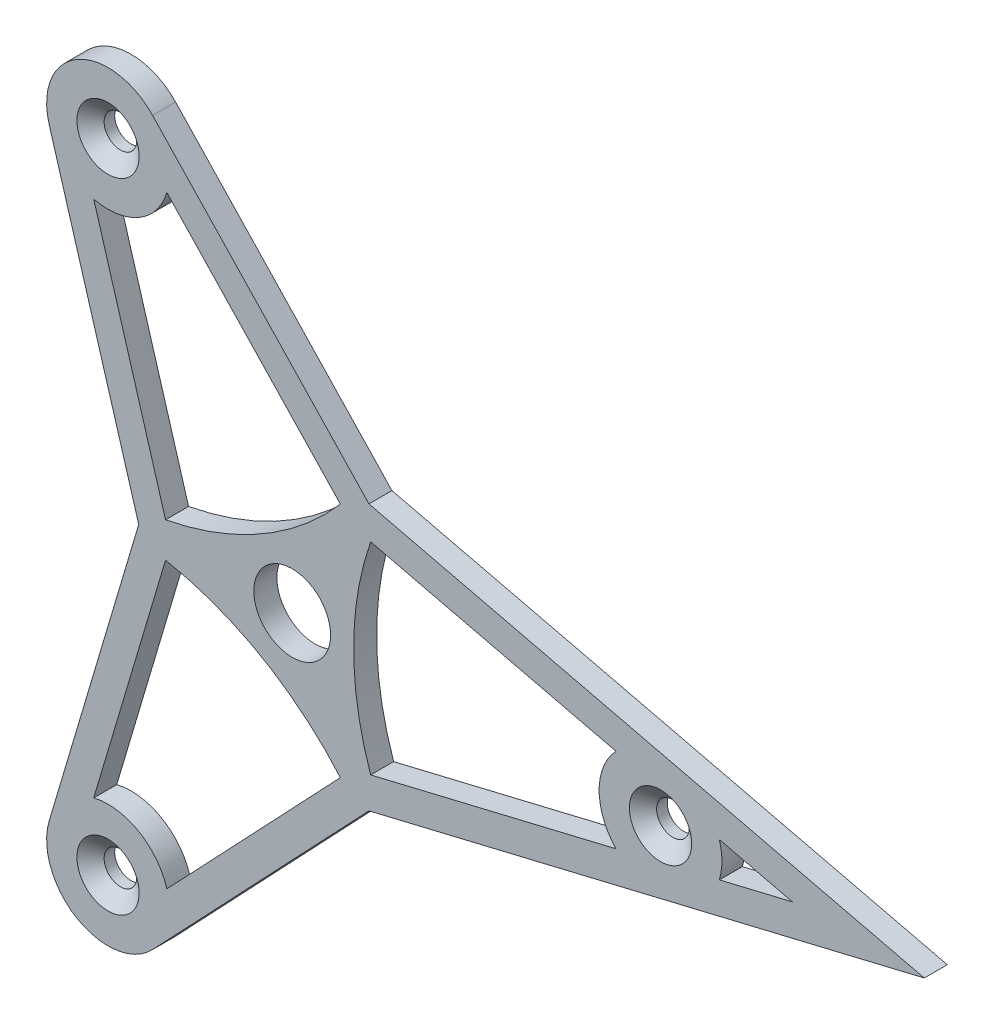
ISO-10303-21;
HEADER;
FILE_DESCRIPTION(('STEP AP214'),'2;1');
FILE_NAME('part.step','',(''),(''),'','','');
FILE_SCHEMA(('AUTOMOTIVE_DESIGN { 1 0 10303 214 1 1 1 1 }'));
ENDSEC;
DATA;
#1=APPLICATION_CONTEXT('core data for automotive mechanical design processes');
#2=APPLICATION_PROTOCOL_DEFINITION('international standard','automotive_design',2000,#1);
#3=PRODUCT_CONTEXT('',#1,'mechanical');
#4=PRODUCT('Part','Part','',(#3));
#5=PRODUCT_RELATED_PRODUCT_CATEGORY('part','',(#4));
#6=PRODUCT_DEFINITION_FORMATION('','',#4);
#7=PRODUCT_DEFINITION_CONTEXT('part definition',#1,'design');
#8=PRODUCT_DEFINITION('design','',#6,#7);
#9=PRODUCT_DEFINITION_SHAPE('','',#8);
#10=(LENGTH_UNIT() NAMED_UNIT(*) SI_UNIT(.MILLI.,.METRE.));
#11=(NAMED_UNIT(*) PLANE_ANGLE_UNIT() SI_UNIT($,.RADIAN.));
#12=(NAMED_UNIT(*) SI_UNIT($,.STERADIAN.) SOLID_ANGLE_UNIT());
#13=UNCERTAINTY_MEASURE_WITH_UNIT(LENGTH_MEASURE(1.E-05),#10,'distance_accuracy_value','');
#14=(GEOMETRIC_REPRESENTATION_CONTEXT(3) GLOBAL_UNCERTAINTY_ASSIGNED_CONTEXT((#13)) GLOBAL_UNIT_ASSIGNED_CONTEXT((#10,
#11,#12)) REPRESENTATION_CONTEXT('',''));
#15=CARTESIAN_POINT('',(0.,0.,0.));
#16=DIRECTION('',(0.,0.,1.));
#17=DIRECTION('',(1.,0.,0.));
#18=AXIS2_PLACEMENT_3D('',#15,#16,#17);
#19=CARTESIAN_POINT('',(-31.75,0.,-4.7625));
#20=DIRECTION('',(-0.958618679777918,0.284693215199875,0.));
#21=DIRECTION('',(-0.284693215199875,-0.958618679777918,0.));
#22=AXIS2_PLACEMENT_3D('',#19,#20,#21);
#23=PLANE('',#22);
#24=DIRECTION('',(-0.284693215199875,-0.958618679777918,0.));
#25=VECTOR('',#24,1.);
#26=CARTESIAN_POINT('',(-31.75,0.,0.));
#27=LINE('',#26,#25);
#28=CARTESIAN_POINT('',(-31.75,0.,0.));
#29=VERTEX_POINT('',#28);
#30=CARTESIAN_POINT('',(-50.2744572331796,-62.3755319353353,0.));
#31=VERTEX_POINT('',#30);
#32=EDGE_CURVE('E372',#29,#31,#27,.T.);
#33=ORIENTED_EDGE('',*,*,#32,.F.);
#34=DIRECTION('',(0.,0.,1.));
#35=VECTOR('',#34,1.);
#36=CARTESIAN_POINT('',(-31.75,0.,-4.7625));
#37=LINE('',#36,#35);
#38=CARTESIAN_POINT('',(-31.75,0.,-4.7625));
#39=VERTEX_POINT('',#38);
#40=EDGE_CURVE('E11',#39,#29,#37,.T.);
#41=ORIENTED_EDGE('',*,*,#40,.F.);
#42=DIRECTION('',(-0.284693215199875,-0.958618679777918,0.));
#43=VECTOR('',#42,1.);
#44=CARTESIAN_POINT('',(-31.75,0.,-4.7625));
#45=LINE('',#44,#43);
#46=CARTESIAN_POINT('',(-50.2744572331796,-62.3755319353353,-4.7625));
#47=VERTEX_POINT('',#46);
#48=EDGE_CURVE('E376',#39,#47,#45,.T.);
#49=ORIENTED_EDGE('',*,*,#48,.T.);
#50=DIRECTION('',(0.,0.,1.));
#51=VECTOR('',#50,1.);
#52=CARTESIAN_POINT('',(-50.2744572331796,-62.3755319353353,-4.7625));
#53=LINE('',#52,#51);
#54=EDGE_CURVE('E42',#47,#31,#53,.T.);
#55=ORIENTED_EDGE('',*,*,#54,.T.);
#56=EDGE_LOOP('',(#33,#41,#49,#55));
#57=FACE_BOUND('',#56,.T.);
#58=ADVANCED_FACE('F39',(#57),#23,.T.);
#59=CARTESIAN_POINT('',(-31.75,0.,-4.7625));
#60=DIRECTION('',(-0.95861867977792,-0.284693215199867,0.));
#61=DIRECTION('',(0.284693215199867,-0.95861867977792,0.));
#62=AXIS2_PLACEMENT_3D('',#59,#60,#61);
#63=PLANE('',#62);
#64=DIRECTION('',(0.284693215199867,-0.95861867977792,0.));
#65=VECTOR('',#64,1.);
#66=CARTESIAN_POINT('',(-31.75,0.,0.));
#67=LINE('',#66,#65);
#68=CARTESIAN_POINT('',(-50.2744572331791,62.3755319353358,0.));
#69=VERTEX_POINT('',#68);
#70=EDGE_CURVE('E381',#69,#29,#67,.T.);
#71=ORIENTED_EDGE('',*,*,#70,.F.);
#72=DIRECTION('',(0.,0.,1.));
#73=VECTOR('',#72,1.);
#74=CARTESIAN_POINT('',(-50.2744572331791,62.3755319353358,-4.7625));
#75=LINE('',#74,#73);
#76=CARTESIAN_POINT('',(-50.2744572331791,62.3755319353358,-4.7625));
#77=VERTEX_POINT('',#76);
#78=EDGE_CURVE('E48',#77,#69,#75,.T.);
#79=ORIENTED_EDGE('',*,*,#78,.F.);
#80=DIRECTION('',(0.284693215199867,-0.95861867977792,0.));
#81=VECTOR('',#80,1.);
#82=CARTESIAN_POINT('',(-31.75,0.,-4.7625));
#83=LINE('',#82,#81);
#84=EDGE_CURVE('E403',#77,#39,#83,.T.);
#85=ORIENTED_EDGE('',*,*,#84,.T.);
#86=ORIENTED_EDGE('',*,*,#40,.T.);
#87=EDGE_LOOP('',(#71,#79,#85,#86));
#88=FACE_BOUND('',#87,.T.);
#89=ADVANCED_FACE('F468',(#88),#63,.T.);
#90=CARTESIAN_POINT('',(-38.0999999999996,65.9911357683741,-4.7625));
#91=DIRECTION('',(0.,0.,1.));
#92=DIRECTION('',(1.,0.,0.));
#93=AXIS2_PLACEMENT_3D('',#90,#91,#92);
#94=CYLINDRICAL_SURFACE('',#93,12.7);
#95=CARTESIAN_POINT('',(-38.0999999999996,65.9911357683741,0.));
#96=DIRECTION('',(0.,0.,1.));
#97=DIRECTION('',(1.,0.,0.));
#98=AXIS2_PLACEMENT_3D('',#95,#96,#97);
#99=CIRCLE('',#98,12.7);
#100=CARTESIAN_POINT('',(-28.8815666139781,74.7267230930756,0.));
#101=VERTEX_POINT('',#100);
#102=EDGE_CURVE('E430',#101,#69,#99,.T.);
#103=ORIENTED_EDGE('',*,*,#102,.F.);
#104=DIRECTION('',(0.,0.,1.));
#105=VECTOR('',#104,1.);
#106=CARTESIAN_POINT('',(-28.8815666139781,74.7267230930756,-4.7625));
#107=LINE('',#106,#105);
#108=CARTESIAN_POINT('',(-28.8815666139781,74.7267230930756,-4.7625));
#109=VERTEX_POINT('',#108);
#110=EDGE_CURVE('E439',#109,#101,#107,.T.);
#111=ORIENTED_EDGE('',*,*,#110,.F.);
#112=CARTESIAN_POINT('',(-38.0999999999996,65.9911357683741,-4.7625));
#113=DIRECTION('',(0.,0.,1.));
#114=DIRECTION('',(1.,0.,0.));
#115=AXIS2_PLACEMENT_3D('',#112,#113,#114);
#116=CIRCLE('',#115,12.7);
#117=EDGE_CURVE('E399',#109,#77,#116,.T.);
#118=ORIENTED_EDGE('',*,*,#117,.T.);
#119=ORIENTED_EDGE('',*,*,#78,.T.);
#120=EDGE_LOOP('',(#103,#111,#118,#119));
#121=FACE_BOUND('',#120,.T.);
#122=ADVANCED_FACE('F488',(#121),#94,.T.);
#123=CARTESIAN_POINT('',(15.8749999999999,27.496306570156,-4.7625));
#124=DIRECTION('',(0.725860896537122,0.687841521630038,0.));
#125=DIRECTION('',(-0.687841521630038,0.725860896537122,0.));
#126=AXIS2_PLACEMENT_3D('',#123,#124,#125);
#127=PLANE('',#126);
#128=DIRECTION('',(-0.687841521630038,0.725860896537122,0.));
#129=VECTOR('',#128,1.);
#130=CARTESIAN_POINT('',(15.8749999999999,27.496306570156,0.));
#131=LINE('',#130,#129);
#132=CARTESIAN_POINT('',(15.8749999999999,27.496306570156,0.));
#133=VERTEX_POINT('',#132);
#134=EDGE_CURVE('E426',#133,#101,#131,.T.);
#135=ORIENTED_EDGE('',*,*,#134,.F.);
#136=DIRECTION('',(0.,0.,1.));
#137=VECTOR('',#136,1.);
#138=CARTESIAN_POINT('',(15.8749999999999,27.496306570156,-4.7625));
#139=LINE('',#138,#137);
#140=CARTESIAN_POINT('',(15.8749999999999,27.496306570156,-4.7625));
#141=VERTEX_POINT('',#140);
#142=EDGE_CURVE('E442',#141,#133,#139,.T.);
#143=ORIENTED_EDGE('',*,*,#142,.F.);
#144=DIRECTION('',(-0.687841521630038,0.725860896537122,0.));
#145=VECTOR('',#144,1.);
#146=CARTESIAN_POINT('',(15.8749999999999,27.496306570156,-4.7625));
#147=LINE('',#146,#145);
#148=EDGE_CURVE('E395',#141,#109,#147,.T.);
#149=ORIENTED_EDGE('',*,*,#148,.T.);
#150=ORIENTED_EDGE('',*,*,#110,.T.);
#151=EDGE_LOOP('',(#135,#143,#149,#150));
#152=FACE_BOUND('',#151,.T.);
#153=ADVANCED_FACE('F486',(#152),#127,.T.);
#154=CARTESIAN_POINT('',(15.8749999999999,27.496306570156,-4.7625));
#155=DIRECTION('',(0.232757783240804,0.972534736829912,0.));
#156=DIRECTION('',(-0.972534736829913,0.232757783240804,0.));
#157=AXIS2_PLACEMENT_3D('',#154,#155,#156);
#158=PLANE('',#157);
#159=DIRECTION('',(-0.972534736829912,0.232757783240804,0.));
#160=VECTOR('',#159,1.);
#161=CARTESIAN_POINT('',(15.8749999999999,27.496306570156,0.));
#162=LINE('',#161,#160);
#163=CARTESIAN_POINT('',(130.763159277303,-3.24393301264684E-13,0.));
#164=VERTEX_POINT('',#163);
#165=EDGE_CURVE('E422',#164,#133,#162,.T.);
#166=ORIENTED_EDGE('',*,*,#165,.F.);
#167=DIRECTION('',(0.,0.,1.));
#168=VECTOR('',#167,1.);
#169=CARTESIAN_POINT('',(130.763159277303,-3.24393301264684E-13,-4.7625));
#170=LINE('',#169,#168);
#171=CARTESIAN_POINT('',(130.763159277303,-3.24393301264684E-13,-4.7625));
#172=VERTEX_POINT('',#171);
#173=EDGE_CURVE('E445',#172,#164,#170,.T.);
#174=ORIENTED_EDGE('',*,*,#173,.F.);
#175=DIRECTION('',(-0.972534736829912,0.232757783240804,0.));
#176=VECTOR('',#175,1.);
#177=CARTESIAN_POINT('',(78.911198700198,12.4097854231473,-4.7625));
#178=LINE('',#177,#176);
#179=EDGE_CURVE('E392',#172,#141,#178,.T.);
#180=ORIENTED_EDGE('',*,*,#179,.T.);
#181=ORIENTED_EDGE('',*,*,#142,.T.);
#182=EDGE_LOOP('',(#166,#174,#180,#181));
#183=FACE_BOUND('',#182,.T.);
#184=ADVANCED_FACE('F481',(#183),#158,.T.);
#185=CARTESIAN_POINT('',(79.1560238471579,-12.3511911577401,-4.7625));
#186=DIRECTION('',(0.2327577832408,-0.972534736829913,0.));
#187=DIRECTION('',(0.972534736829913,0.2327577832408,0.));
#188=AXIS2_PLACEMENT_3D('',#185,#186,#187);
#189=PLANE('',#188);
#190=DIRECTION('',(0.972534736829913,0.2327577832408,0.));
#191=VECTOR('',#190,1.);
#192=CARTESIAN_POINT('',(79.1560238471579,-12.3511911577401,0.));
#193=LINE('',#192,#191);
#194=CARTESIAN_POINT('',(15.8749999999994,-27.4963065701563,0.));
#195=VERTEX_POINT('',#194);
#196=EDGE_CURVE('E418',#195,#164,#193,.T.);
#197=ORIENTED_EDGE('',*,*,#196,.F.);
#198=DIRECTION('',(0.,0.,1.));
#199=VECTOR('',#198,1.);
#200=CARTESIAN_POINT('',(15.8749999999994,-27.4963065701563,-4.7625));
#201=LINE('',#200,#199);
#202=CARTESIAN_POINT('',(15.8749999999994,-27.4963065701563,-4.7625));
#203=VERTEX_POINT('',#202);
#204=EDGE_CURVE('E449',#203,#195,#201,.T.);
#205=ORIENTED_EDGE('',*,*,#204,.F.);
#206=DIRECTION('',(0.972534736829913,0.2327577832408,0.));
#207=VECTOR('',#206,1.);
#208=CARTESIAN_POINT('',(15.8749999999994,-27.4963065701563,-4.7625));
#209=LINE('',#208,#207);
#210=EDGE_CURVE('E389',#203,#172,#209,.T.);
#211=ORIENTED_EDGE('',*,*,#210,.T.);
#212=ORIENTED_EDGE('',*,*,#173,.T.);
#213=EDGE_LOOP('',(#197,#205,#211,#212));
#214=FACE_BOUND('',#213,.T.);
#215=ADVANCED_FACE('F478',(#214),#189,.T.);
#216=CARTESIAN_POINT('',(15.8749999999994,-27.4963065701563,-4.7625));
#217=DIRECTION('',(0.725860896537117,-0.687841521630042,0.));
#218=DIRECTION('',(0.687841521630043,0.725860896537117,0.));
#219=AXIS2_PLACEMENT_3D('',#216,#217,#218);
#220=PLANE('',#219);
#221=DIRECTION('',(0.687841521630043,0.725860896537117,0.));
#222=VECTOR('',#221,1.);
#223=CARTESIAN_POINT('',(15.8749999999994,-27.4963065701563,0.));
#224=LINE('',#223,#222);
#225=CARTESIAN_POINT('',(-28.8815666139786,-74.7267230930753,0.));
#226=VERTEX_POINT('',#225);
#227=EDGE_CURVE('E414',#226,#195,#224,.T.);
#228=ORIENTED_EDGE('',*,*,#227,.F.);
#229=DIRECTION('',(0.,0.,1.));
#230=VECTOR('',#229,1.);
#231=CARTESIAN_POINT('',(-28.8815666139786,-74.7267230930753,-4.7625));
#232=LINE('',#231,#230);
#233=CARTESIAN_POINT('',(-28.8815666139786,-74.7267230930753,-4.7625));
#234=VERTEX_POINT('',#233);
#235=EDGE_CURVE('E452',#234,#226,#232,.T.);
#236=ORIENTED_EDGE('',*,*,#235,.F.);
#237=DIRECTION('',(0.687841521630043,0.725860896537117,0.));
#238=VECTOR('',#237,1.);
#239=CARTESIAN_POINT('',(15.8749999999994,-27.4963065701563,-4.7625));
#240=LINE('',#239,#238);
#241=EDGE_CURVE('E385',#234,#203,#240,.T.);
#242=ORIENTED_EDGE('',*,*,#241,.T.);
#243=ORIENTED_EDGE('',*,*,#204,.T.);
#244=EDGE_LOOP('',(#228,#236,#242,#243));
#245=FACE_BOUND('',#244,.T.);
#246=ADVANCED_FACE('F476',(#245),#220,.T.);
#247=CARTESIAN_POINT('',(-38.1,-65.9911357683737,-4.7625));
#248=DIRECTION('',(0.,0.,1.));
#249=DIRECTION('',(1.,0.,0.));
#250=AXIS2_PLACEMENT_3D('',#247,#248,#249);
#251=CYLINDRICAL_SURFACE('',#250,12.7);
#252=CARTESIAN_POINT('',(-38.1,-65.9911357683737,0.));
#253=DIRECTION('',(0.,0.,1.));
#254=DIRECTION('',(1.,0.,0.));
#255=AXIS2_PLACEMENT_3D('',#252,#253,#254);
#256=CIRCLE('',#255,12.7);
#257=EDGE_CURVE('E410',#31,#226,#256,.T.);
#258=ORIENTED_EDGE('',*,*,#257,.F.);
#259=ORIENTED_EDGE('',*,*,#54,.F.);
#260=CARTESIAN_POINT('',(-38.1,-65.9911357683737,-4.7625));
#261=DIRECTION('',(0.,0.,1.));
#262=DIRECTION('',(1.,0.,0.));
#263=AXIS2_PLACEMENT_3D('',#260,#261,#262);
#264=CIRCLE('',#263,12.7);
#265=EDGE_CURVE('E380',#47,#234,#264,.T.);
#266=ORIENTED_EDGE('',*,*,#265,.T.);
#267=ORIENTED_EDGE('',*,*,#235,.T.);
#268=EDGE_LOOP('',(#258,#259,#266,#267));
#269=FACE_BOUND('',#268,.T.);
#270=ADVANCED_FACE('F462',(#269),#251,.T.);
#271=CARTESIAN_POINT('',(-38.1,-65.9911357683737,-4.7625));
#272=DIRECTION('',(0.,0.,1.));
#273=DIRECTION('',(1.,0.,0.));
#274=AXIS2_PLACEMENT_3D('',#271,#272,#273);
#275=PLANE('',#274);
#276=CARTESIAN_POINT('',(76.2,0.,-4.7625));
#277=DIRECTION('',(0.,0.,1.));
#278=DIRECTION('',(1.,0.,0.));
#279=AXIS2_PLACEMENT_3D('',#276,#277,#278);
#280=CIRCLE('',#279,3.3782);
#281=CARTESIAN_POINT('',(79.5782,0.,-4.7625));
#282=VERTEX_POINT('',#281);
#283=EDGE_CURVE('E794',#282,#282,#280,.T.);
#284=ORIENTED_EDGE('',*,*,#283,.T.);
#285=EDGE_LOOP('',(#284));
#286=FACE_BOUND('',#285,.T.);
#287=CARTESIAN_POINT('',(-38.0999999999992,65.9911357683743,-4.7625));
#288=DIRECTION('',(0.,0.,1.));
#289=DIRECTION('',(1.,0.,0.));
#290=AXIS2_PLACEMENT_3D('',#287,#288,#289);
#291=CIRCLE('',#290,3.3782);
#292=CARTESIAN_POINT('',(-34.7217999999992,65.9911357683743,-4.7625));
#293=VERTEX_POINT('',#292);
#294=EDGE_CURVE('E808',#293,#293,#291,.T.);
#295=ORIENTED_EDGE('',*,*,#294,.T.);
#296=EDGE_LOOP('',(#295));
#297=FACE_BOUND('',#296,.T.);
#298=CARTESIAN_POINT('',(-38.0999999999997,-65.9911357683735,-4.7625));
#299=DIRECTION('',(0.,0.,1.));
#300=DIRECTION('',(1.,0.,0.));
#301=AXIS2_PLACEMENT_3D('',#298,#299,#300);
#302=CIRCLE('',#301,3.3782);
#303=CARTESIAN_POINT('',(-34.7217999999997,-65.9911357683735,-4.7625));
#304=VERTEX_POINT('',#303);
#305=EDGE_CURVE('E223',#304,#304,#302,.T.);
#306=ORIENTED_EDGE('',*,*,#305,.T.);
#307=EDGE_LOOP('',(#306));
#308=FACE_BOUND('',#307,.T.);
#309=DIRECTION('',(0.972534736829913,0.2327577832408,0.));
#310=VECTOR('',#309,1.);
#311=CARTESIAN_POINT('',(16.2316117473112,-20.8816285374198,-4.7625));
#312=LINE('',#311,#310);
#313=CARTESIAN_POINT('',(16.2316117473112,-20.8816285374198,-4.7625));
#314=VERTEX_POINT('',#313);
#315=CARTESIAN_POINT('',(66.9815666139783,-8.73558732470175,-4.7625));
#316=VERTEX_POINT('',#315);
#317=EDGE_CURVE('E204',#314,#316,#312,.T.);
#318=ORIENTED_EDGE('',*,*,#317,.T.);
#319=CARTESIAN_POINT('',(76.1999999999997,-2.17686979553376E-13,-4.7625));
#320=DIRECTION('',(0.,0.,-1.));
#321=DIRECTION('',(1.,0.,0.));
#322=AXIS2_PLACEMENT_3D('',#319,#320,#321);
#323=CIRCLE('',#322,12.7);
#324=CARTESIAN_POINT('',(66.9815666139783,8.73558732470135,-4.7625));
#325=VERTEX_POINT('',#324);
#326=EDGE_CURVE('E197',#316,#325,#323,.T.);
#327=ORIENTED_EDGE('',*,*,#326,.T.);
#328=DIRECTION('',(-0.972534736829913,0.232757783240804,0.));
#329=VECTOR('',#328,1.);
#330=CARTESIAN_POINT('',(16.2316117473113,20.8816285374197,-4.7625));
#331=LINE('',#330,#329);
#332=CARTESIAN_POINT('',(16.2316117473113,20.8816285374196,-4.7625));
#333=VERTEX_POINT('',#332);
#334=EDGE_CURVE('E207',#325,#333,#331,.T.);
#335=ORIENTED_EDGE('',*,*,#334,.T.);
#336=CARTESIAN_POINT('',(76.1999999999997,-2.17686979553376E-13,-4.7625));
#337=DIRECTION('',(0.,0.,1.));
#338=DIRECTION('',(1.,0.,0.));
#339=AXIS2_PLACEMENT_3D('',#336,#337,#338);
#340=CIRCLE('',#339,63.4999999999997);
#341=EDGE_CURVE('E56',#333,#314,#340,.T.);
#342=ORIENTED_EDGE('',*,*,#341,.T.);
#343=EDGE_LOOP('',(#318,#327,#335,#342));
#344=FACE_BOUND('',#343,.T.);
#345=DIRECTION('',(-0.284693215199875,-0.958618679777917,0.));
#346=VECTOR('',#345,1.);
#347=CARTESIAN_POINT('',(-26.1998266594511,-3.61617384882755,-4.7625));
#348=LINE('',#347,#346);
#349=CARTESIAN_POINT('',(-26.1998266594511,-3.61617384882756,-4.7625));
#350=VERTEX_POINT('',#349);
#351=CARTESIAN_POINT('',(-41.0560238471581,-53.6399446106338,-4.7625));
#352=VERTEX_POINT('',#351);
#353=EDGE_CURVE('E260',#350,#352,#348,.T.);
#354=ORIENTED_EDGE('',*,*,#353,.T.);
#355=CARTESIAN_POINT('',(-38.1,-65.9911357683737,-4.7625));
#356=DIRECTION('',(0.,0.,-1.));
#357=DIRECTION('',(1.,0.,0.));
#358=AXIS2_PLACEMENT_3D('',#355,#356,#357);
#359=CIRCLE('',#358,12.7);
#360=CARTESIAN_POINT('',(-25.9255427668204,-62.3755319353354,-4.7625));
#361=VERTEX_POINT('',#360);
#362=EDGE_CURVE('E247',#352,#361,#359,.T.);
#363=ORIENTED_EDGE('',*,*,#362,.T.);
#364=DIRECTION('',(0.687841521630043,0.725860896537117,0.));
#365=VECTOR('',#364,1.);
#366=CARTESIAN_POINT('',(9.96821491213968,-24.4978023862472,-4.7625));
#367=LINE('',#366,#365);
#368=CARTESIAN_POINT('',(9.96821491213969,-24.4978023862472,-4.7625));
#369=VERTEX_POINT('',#368);
#370=EDGE_CURVE('E251',#361,#369,#367,.T.);
#371=ORIENTED_EDGE('',*,*,#370,.T.);
#372=CARTESIAN_POINT('',(-38.1,-65.9911357683737,-4.7625));
#373=DIRECTION('',(0.,0.,1.));
#374=DIRECTION('',(1.,0.,0.));
#375=AXIS2_PLACEMENT_3D('',#372,#373,#374);
#376=CIRCLE('',#375,63.4999999999996);
#377=EDGE_CURVE('E256',#369,#350,#376,.T.);
#378=ORIENTED_EDGE('',*,*,#377,.T.);
#379=EDGE_LOOP('',(#354,#363,#371,#378));
#380=FACE_BOUND('',#379,.T.);
#381=DIRECTION('',(-0.972534736829912,0.232757783240804,0.));
#382=VECTOR('',#381,1.);
#383=CARTESIAN_POINT('',(88.3744572331793,3.61560383303811,-4.7625));
#384=LINE('',#383,#382);
#385=CARTESIAN_POINT('',(103.481579638652,-2.63677968348475E-13,-4.7625));
#386=VERTEX_POINT('',#385);
#387=CARTESIAN_POINT('',(88.3744572331793,3.61560383303811,-4.7625));
#388=VERTEX_POINT('',#387);
#389=EDGE_CURVE('E300',#386,#388,#384,.T.);
#390=ORIENTED_EDGE('',*,*,#389,.T.);
#391=CARTESIAN_POINT('',(76.1999999999997,-2.17686979553376E-13,-4.7625));
#392=DIRECTION('',(0.,0.,-1.));
#393=DIRECTION('',(1.,0.,0.));
#394=AXIS2_PLACEMENT_3D('',#391,#392,#393);
#395=CIRCLE('',#394,12.7);
#396=CARTESIAN_POINT('',(88.3744572331793,-3.61560383303859,-4.7625));
#397=VERTEX_POINT('',#396);
#398=EDGE_CURVE('E291',#388,#397,#395,.T.);
#399=ORIENTED_EDGE('',*,*,#398,.T.);
#400=DIRECTION('',(0.972534736829913,0.2327577832408,0.));
#401=VECTOR('',#400,1.);
#402=CARTESIAN_POINT('',(88.3744572331793,-3.61560383303859,-4.7625));
#403=LINE('',#402,#401);
#404=EDGE_CURVE('E295',#397,#386,#403,.T.);
#405=ORIENTED_EDGE('',*,*,#404,.T.);
#406=EDGE_LOOP('',(#390,#399,#405));
#407=FACE_BOUND('',#406,.T.);
#408=DIRECTION('',(-0.687841521630038,0.725860896537122,0.));
#409=VECTOR('',#408,1.);
#410=CARTESIAN_POINT('',(9.96821491213995,24.4978023862472,-4.7625));
#411=LINE('',#410,#409);
#412=CARTESIAN_POINT('',(9.96821491213995,24.4978023862472,-4.7625));
#413=VERTEX_POINT('',#412);
#414=CARTESIAN_POINT('',(-25.92554276682,62.3755319353357,-4.7625));
#415=VERTEX_POINT('',#414);
#416=EDGE_CURVE('E337',#413,#415,#411,.T.);
#417=ORIENTED_EDGE('',*,*,#416,.T.);
#418=CARTESIAN_POINT('',(-38.0999999999996,65.9911357683741,-4.7625));
#419=DIRECTION('',(0.,0.,-1.));
#420=DIRECTION('',(1.,0.,0.));
#421=AXIS2_PLACEMENT_3D('',#418,#419,#420);
#422=CIRCLE('',#421,12.7);
#423=CARTESIAN_POINT('',(-41.0560238471578,53.6399446106342,-4.7625));
#424=VERTEX_POINT('',#423);
#425=EDGE_CURVE('E324',#415,#424,#422,.T.);
#426=ORIENTED_EDGE('',*,*,#425,.T.);
#427=DIRECTION('',(0.284693215199867,-0.95861867977792,0.));
#428=VECTOR('',#427,1.);
#429=CARTESIAN_POINT('',(-26.1998266594511,3.61617384882772,-4.7625));
#430=LINE('',#429,#428);
#431=CARTESIAN_POINT('',(-26.1998266594511,3.61617384882773,-4.7625));
#432=VERTEX_POINT('',#431);
#433=EDGE_CURVE('E328',#424,#432,#430,.T.);
#434=ORIENTED_EDGE('',*,*,#433,.T.);
#435=CARTESIAN_POINT('',(-38.0999999999996,65.9911357683741,-4.7625));
#436=DIRECTION('',(0.,0.,1.));
#437=DIRECTION('',(1.,0.,0.));
#438=AXIS2_PLACEMENT_3D('',#435,#436,#437);
#439=CIRCLE('',#438,63.4999999999997);
#440=EDGE_CURVE('E333',#432,#413,#439,.T.);
#441=ORIENTED_EDGE('',*,*,#440,.T.);
#442=EDGE_LOOP('',(#417,#426,#434,#441));
#443=FACE_BOUND('',#442,.T.);
#444=CARTESIAN_POINT('',(0.,0.,-4.7625));
#445=DIRECTION('',(0.,0.,1.));
#446=DIRECTION('',(1.,0.,0.));
#447=AXIS2_PLACEMENT_3D('',#444,#445,#446);
#448=CIRCLE('',#447,7.9375);
#449=CARTESIAN_POINT('',(7.9375,0.,-4.7625));
#450=VERTEX_POINT('',#449);
#451=EDGE_CURVE('E368',#450,#450,#448,.T.);
#452=ORIENTED_EDGE('',*,*,#451,.T.);
#453=EDGE_LOOP('',(#452));
#454=FACE_BOUND('',#453,.T.);
#455=ORIENTED_EDGE('',*,*,#48,.F.);
#456=ORIENTED_EDGE('',*,*,#84,.F.);
#457=ORIENTED_EDGE('',*,*,#117,.F.);
#458=ORIENTED_EDGE('',*,*,#148,.F.);
#459=ORIENTED_EDGE('',*,*,#179,.F.);
#460=ORIENTED_EDGE('',*,*,#210,.F.);
#461=ORIENTED_EDGE('',*,*,#241,.F.);
#462=ORIENTED_EDGE('',*,*,#265,.F.);
#463=EDGE_LOOP('',(#455,#456,#457,#458,#459,#460,#461,#462));
#464=FACE_BOUND('',#463,.T.);
#465=ADVANCED_FACE('F212',(#286,#297,#308,#344,#380,#407,#443,#454,#464),#275,.F.);
#466=CARTESIAN_POINT('',(-38.1,-65.9911357683737,0.));
#467=DIRECTION('',(0.,0.,1.));
#468=DIRECTION('',(1.,0.,0.));
#469=AXIS2_PLACEMENT_3D('',#466,#467,#468);
#470=PLANE('',#469);
#471=CARTESIAN_POINT('',(76.2,0.,0.));
#472=DIRECTION('',(0.,0.,1.));
#473=DIRECTION('',(1.,0.,0.));
#474=AXIS2_PLACEMENT_3D('',#471,#472,#473);
#475=CIRCLE('',#474,6.4389);
#476=CARTESIAN_POINT('',(82.6389,0.,0.));
#477=VERTEX_POINT('',#476);
#478=EDGE_CURVE('E790',#477,#477,#475,.T.);
#479=ORIENTED_EDGE('',*,*,#478,.F.);
#480=EDGE_LOOP('',(#479));
#481=FACE_BOUND('',#480,.T.);
#482=CARTESIAN_POINT('',(-38.0999999999992,65.9911357683743,0.));
#483=DIRECTION('',(0.,0.,1.));
#484=DIRECTION('',(1.,0.,0.));
#485=AXIS2_PLACEMENT_3D('',#482,#483,#484);
#486=CIRCLE('',#485,6.4389);
#487=CARTESIAN_POINT('',(-31.6610999999992,65.9911357683743,0.));
#488=VERTEX_POINT('',#487);
#489=EDGE_CURVE('E800',#488,#488,#486,.T.);
#490=ORIENTED_EDGE('',*,*,#489,.F.);
#491=EDGE_LOOP('',(#490));
#492=FACE_BOUND('',#491,.T.);
#493=CARTESIAN_POINT('',(-38.0999999999997,-65.9911357683735,0.));
#494=DIRECTION('',(0.,0.,1.));
#495=DIRECTION('',(1.,0.,0.));
#496=AXIS2_PLACEMENT_3D('',#493,#494,#495);
#497=CIRCLE('',#496,6.4389);
#498=CARTESIAN_POINT('',(-31.6610999999997,-65.9911357683735,0.));
#499=VERTEX_POINT('',#498);
#500=EDGE_CURVE('E812',#499,#499,#497,.T.);
#501=ORIENTED_EDGE('',*,*,#500,.F.);
#502=EDGE_LOOP('',(#501));
#503=FACE_BOUND('',#502,.T.);
#504=CARTESIAN_POINT('',(76.1999999999997,-2.17686979553376E-13,0.));
#505=DIRECTION('',(0.,0.,-1.));
#506=DIRECTION('',(1.,0.,0.));
#507=AXIS2_PLACEMENT_3D('',#504,#505,#506);
#508=CIRCLE('',#507,12.7);
#509=CARTESIAN_POINT('',(66.9815666139783,-8.73558732470175,0.));
#510=VERTEX_POINT('',#509);
#511=CARTESIAN_POINT('',(66.9815666139783,8.73558732470133,0.));
#512=VERTEX_POINT('',#511);
#513=EDGE_CURVE('E64',#510,#512,#508,.T.);
#514=ORIENTED_EDGE('',*,*,#513,.F.);
#515=DIRECTION('',(0.972534736829913,0.2327577832408,0.));
#516=VECTOR('',#515,1.);
#517=CARTESIAN_POINT('',(16.2316117473112,-20.8816285374198,0.));
#518=LINE('',#517,#516);
#519=CARTESIAN_POINT('',(16.2316117473112,-20.8816285374198,0.));
#520=VERTEX_POINT('',#519);
#521=EDGE_CURVE('E216',#520,#510,#518,.T.);
#522=ORIENTED_EDGE('',*,*,#521,.F.);
#523=CARTESIAN_POINT('',(76.1999999999997,-2.17686979553376E-13,0.));
#524=DIRECTION('',(0.,0.,1.));
#525=DIRECTION('',(1.,0.,0.));
#526=AXIS2_PLACEMENT_3D('',#523,#524,#525);
#527=CIRCLE('',#526,63.4999999999997);
#528=CARTESIAN_POINT('',(16.2316117473113,20.8816285374197,0.));
#529=VERTEX_POINT('',#528);
#530=EDGE_CURVE('E220',#529,#520,#527,.T.);
#531=ORIENTED_EDGE('',*,*,#530,.F.);
#532=DIRECTION('',(-0.972534736829913,0.232757783240804,0.));
#533=VECTOR('',#532,1.);
#534=CARTESIAN_POINT('',(16.2316117473113,20.8816285374197,0.));
#535=LINE('',#534,#533);
#536=EDGE_CURVE('E232',#512,#529,#535,.T.);
#537=ORIENTED_EDGE('',*,*,#536,.F.);
#538=EDGE_LOOP('',(#514,#522,#531,#537));
#539=FACE_BOUND('',#538,.T.);
#540=CARTESIAN_POINT('',(-38.1,-65.9911357683737,0.));
#541=DIRECTION('',(0.,0.,-1.));
#542=DIRECTION('',(1.,0.,0.));
#543=AXIS2_PLACEMENT_3D('',#540,#541,#542);
#544=CIRCLE('',#543,12.7);
#545=CARTESIAN_POINT('',(-41.0560238471581,-53.6399446106338,0.));
#546=VERTEX_POINT('',#545);
#547=CARTESIAN_POINT('',(-25.9255427668204,-62.3755319353354,0.));
#548=VERTEX_POINT('',#547);
#549=EDGE_CURVE('E241',#546,#548,#544,.T.);
#550=ORIENTED_EDGE('',*,*,#549,.F.);
#551=DIRECTION('',(-0.284693215199875,-0.958618679777917,0.));
#552=VECTOR('',#551,1.);
#553=CARTESIAN_POINT('',(-26.1998266594511,-3.61617384882755,0.));
#554=LINE('',#553,#552);
#555=CARTESIAN_POINT('',(-26.1998266594511,-3.61617384882756,0.));
#556=VERTEX_POINT('',#555);
#557=EDGE_CURVE('E252',#556,#546,#554,.T.);
#558=ORIENTED_EDGE('',*,*,#557,.F.);
#559=CARTESIAN_POINT('',(-38.1,-65.9911357683737,0.));
#560=DIRECTION('',(0.,0.,1.));
#561=DIRECTION('',(1.,0.,0.));
#562=AXIS2_PLACEMENT_3D('',#559,#560,#561);
#563=CIRCLE('',#562,63.4999999999996);
#564=CARTESIAN_POINT('',(9.96821491213968,-24.4978023862472,0.));
#565=VERTEX_POINT('',#564);
#566=EDGE_CURVE('E271',#565,#556,#563,.T.);
#567=ORIENTED_EDGE('',*,*,#566,.F.);
#568=DIRECTION('',(0.687841521630043,0.725860896537117,0.));
#569=VECTOR('',#568,1.);
#570=CARTESIAN_POINT('',(9.96821491213968,-24.4978023862472,0.));
#571=LINE('',#570,#569);
#572=EDGE_CURVE('E267',#548,#565,#571,.T.);
#573=ORIENTED_EDGE('',*,*,#572,.F.);
#574=EDGE_LOOP('',(#550,#558,#567,#573));
#575=FACE_BOUND('',#574,.T.);
#576=CARTESIAN_POINT('',(76.1999999999997,-2.17686979553376E-13,0.));
#577=DIRECTION('',(0.,0.,-1.));
#578=DIRECTION('',(1.,0.,0.));
#579=AXIS2_PLACEMENT_3D('',#576,#577,#578);
#580=CIRCLE('',#579,12.7);
#581=CARTESIAN_POINT('',(88.3744572331793,3.61560383303811,0.));
#582=VERTEX_POINT('',#581);
#583=CARTESIAN_POINT('',(88.3744572331793,-3.61560383303858,0.));
#584=VERTEX_POINT('',#583);
#585=EDGE_CURVE('E281',#582,#584,#580,.T.);
#586=ORIENTED_EDGE('',*,*,#585,.F.);
#587=DIRECTION('',(-0.972534736829912,0.232757783240804,0.));
#588=VECTOR('',#587,1.);
#589=CARTESIAN_POINT('',(88.3744572331793,3.61560383303811,0.));
#590=LINE('',#589,#588);
#591=CARTESIAN_POINT('',(103.481579638652,-2.72351585728359E-13,0.));
#592=VERTEX_POINT('',#591);
#593=EDGE_CURVE('E296',#592,#582,#590,.T.);
#594=ORIENTED_EDGE('',*,*,#593,.F.);
#595=DIRECTION('',(0.972534736829913,0.2327577832408,0.));
#596=VECTOR('',#595,1.);
#597=CARTESIAN_POINT('',(88.3744572331793,-3.61560383303859,0.));
#598=LINE('',#597,#596);
#599=EDGE_CURVE('E307',#584,#592,#598,.T.);
#600=ORIENTED_EDGE('',*,*,#599,.F.);
#601=EDGE_LOOP('',(#586,#594,#600));
#602=FACE_BOUND('',#601,.T.);
#603=CARTESIAN_POINT('',(-38.0999999999996,65.9911357683741,0.));
#604=DIRECTION('',(0.,0.,-1.));
#605=DIRECTION('',(1.,0.,0.));
#606=AXIS2_PLACEMENT_3D('',#603,#604,#605);
#607=CIRCLE('',#606,12.7);
#608=CARTESIAN_POINT('',(-25.92554276682,62.3755319353357,0.));
#609=VERTEX_POINT('',#608);
#610=CARTESIAN_POINT('',(-41.0560238471578,53.6399446106342,0.));
#611=VERTEX_POINT('',#610);
#612=EDGE_CURVE('E317',#609,#611,#607,.T.);
#613=ORIENTED_EDGE('',*,*,#612,.F.);
#614=DIRECTION('',(-0.687841521630038,0.725860896537122,0.));
#615=VECTOR('',#614,1.);
#616=CARTESIAN_POINT('',(9.96821491213995,24.4978023862472,0.));
#617=LINE('',#616,#615);
#618=CARTESIAN_POINT('',(9.96821491213995,24.4978023862472,0.));
#619=VERTEX_POINT('',#618);
#620=EDGE_CURVE('E329',#619,#609,#617,.T.);
#621=ORIENTED_EDGE('',*,*,#620,.F.);
#622=CARTESIAN_POINT('',(-38.0999999999996,65.9911357683741,0.));
#623=DIRECTION('',(0.,0.,1.));
#624=DIRECTION('',(1.,0.,0.));
#625=AXIS2_PLACEMENT_3D('',#622,#623,#624);
#626=CIRCLE('',#625,63.4999999999997);
#627=CARTESIAN_POINT('',(-26.1998266594511,3.61617384882773,0.));
#628=VERTEX_POINT('',#627);
#629=EDGE_CURVE('E348',#628,#619,#626,.T.);
#630=ORIENTED_EDGE('',*,*,#629,.F.);
#631=DIRECTION('',(0.284693215199867,-0.95861867977792,0.));
#632=VECTOR('',#631,1.);
#633=CARTESIAN_POINT('',(-26.1998266594511,3.61617384882772,0.));
#634=LINE('',#633,#632);
#635=EDGE_CURVE('E344',#611,#628,#634,.T.);
#636=ORIENTED_EDGE('',*,*,#635,.F.);
#637=EDGE_LOOP('',(#613,#621,#630,#636));
#638=FACE_BOUND('',#637,.T.);
#639=CARTESIAN_POINT('',(0.,0.,0.));
#640=DIRECTION('',(0.,0.,1.));
#641=DIRECTION('',(1.,0.,0.));
#642=AXIS2_PLACEMENT_3D('',#639,#640,#641);
#643=CIRCLE('',#642,7.9375);
#644=CARTESIAN_POINT('',(7.9375,0.,0.));
#645=VERTEX_POINT('',#644);
#646=EDGE_CURVE('E358',#645,#645,#643,.T.);
#647=ORIENTED_EDGE('',*,*,#646,.F.);
#648=EDGE_LOOP('',(#647));
#649=FACE_BOUND('',#648,.T.);
#650=ORIENTED_EDGE('',*,*,#32,.T.);
#651=ORIENTED_EDGE('',*,*,#257,.T.);
#652=ORIENTED_EDGE('',*,*,#227,.T.);
#653=ORIENTED_EDGE('',*,*,#196,.T.);
#654=ORIENTED_EDGE('',*,*,#165,.T.);
#655=ORIENTED_EDGE('',*,*,#134,.T.);
#656=ORIENTED_EDGE('',*,*,#102,.T.);
#657=ORIENTED_EDGE('',*,*,#70,.T.);
#658=EDGE_LOOP('',(#650,#651,#652,#653,#654,#655,#656,#657));
#659=FACE_BOUND('',#658,.T.);
#660=ADVANCED_FACE('F464',(#481,#492,#503,#539,#575,#602,#638,#649,#659),#470,.T.);
#661=CARTESIAN_POINT('',(0.,0.,-4.7625));
#662=DIRECTION('',(0.,0.,1.));
#663=DIRECTION('',(1.,0.,0.));
#664=AXIS2_PLACEMENT_3D('',#661,#662,#663);
#665=CYLINDRICAL_SURFACE('',#664,7.9375);
#666=ORIENTED_EDGE('',*,*,#451,.F.);
#667=EDGE_LOOP('',(#666));
#668=FACE_BOUND('',#667,.T.);
#669=ORIENTED_EDGE('',*,*,#646,.T.);
#670=EDGE_LOOP('',(#669));
#671=FACE_BOUND('',#670,.T.);
#672=ADVANCED_FACE('F554',(#668,#671),#665,.F.);
#673=CARTESIAN_POINT('',(-38.0999999999996,65.9911357683741,-4.7625));
#674=DIRECTION('',(0.,0.,1.));
#675=DIRECTION('',(1.,0.,0.));
#676=AXIS2_PLACEMENT_3D('',#673,#674,#675);
#677=CYLINDRICAL_SURFACE('',#676,12.7);
#678=ORIENTED_EDGE('',*,*,#612,.T.);
#679=DIRECTION('',(0.,0.,1.));
#680=VECTOR('',#679,1.);
#681=CARTESIAN_POINT('',(-41.0560238471578,53.6399446106342,-4.7625));
#682=LINE('',#681,#680);
#683=EDGE_CURVE('E341',#424,#611,#682,.T.);
#684=ORIENTED_EDGE('',*,*,#683,.F.);
#685=ORIENTED_EDGE('',*,*,#425,.F.);
#686=DIRECTION('',(0.,0.,1.));
#687=VECTOR('',#686,1.);
#688=CARTESIAN_POINT('',(-25.92554276682,62.3755319353357,-4.7625));
#689=LINE('',#688,#687);
#690=EDGE_CURVE('E355',#415,#609,#689,.T.);
#691=ORIENTED_EDGE('',*,*,#690,.T.);
#692=EDGE_LOOP('',(#678,#684,#685,#691));
#693=FACE_BOUND('',#692,.T.);
#694=ADVANCED_FACE('F559',(#693),#677,.T.);
#695=CARTESIAN_POINT('',(9.96821491213995,24.4978023862472,-4.7625));
#696=DIRECTION('',(0.725860896537122,0.687841521630038,0.));
#697=DIRECTION('',(-0.687841521630038,0.725860896537122,0.));
#698=AXIS2_PLACEMENT_3D('',#695,#696,#697);
#699=PLANE('',#698);
#700=ORIENTED_EDGE('',*,*,#620,.T.);
#701=ORIENTED_EDGE('',*,*,#690,.F.);
#702=ORIENTED_EDGE('',*,*,#416,.F.);
#703=DIRECTION('',(0.,0.,1.));
#704=VECTOR('',#703,1.);
#705=CARTESIAN_POINT('',(9.96821491213995,24.4978023862472,-4.7625));
#706=LINE('',#705,#704);
#707=EDGE_CURVE('E359',#413,#619,#706,.T.);
#708=ORIENTED_EDGE('',*,*,#707,.T.);
#709=EDGE_LOOP('',(#700,#701,#702,#708));
#710=FACE_BOUND('',#709,.T.);
#711=ADVANCED_FACE('F571',(#710),#699,.F.);
#712=CARTESIAN_POINT('',(-38.0999999999996,65.9911357683741,-4.7625));
#713=DIRECTION('',(0.,0.,1.));
#714=DIRECTION('',(1.,0.,0.));
#715=AXIS2_PLACEMENT_3D('',#712,#713,#714);
#716=CYLINDRICAL_SURFACE('',#715,63.4999999999997);
#717=ORIENTED_EDGE('',*,*,#629,.T.);
#718=ORIENTED_EDGE('',*,*,#707,.F.);
#719=ORIENTED_EDGE('',*,*,#440,.F.);
#720=DIRECTION('',(0.,0.,1.));
#721=VECTOR('',#720,1.);
#722=CARTESIAN_POINT('',(-26.1998266594511,3.61617384882773,-4.7625));
#723=LINE('',#722,#721);
#724=EDGE_CURVE('E362',#432,#628,#723,.T.);
#725=ORIENTED_EDGE('',*,*,#724,.T.);
#726=EDGE_LOOP('',(#717,#718,#719,#725));
#727=FACE_BOUND('',#726,.T.);
#728=ADVANCED_FACE('F581',(#727),#716,.F.);
#729=CARTESIAN_POINT('',(-26.1998266594511,3.61617384882772,-4.7625));
#730=DIRECTION('',(-0.95861867977792,-0.284693215199867,0.));
#731=DIRECTION('',(0.284693215199867,-0.95861867977792,0.));
#732=AXIS2_PLACEMENT_3D('',#729,#730,#731);
#733=PLANE('',#732);
#734=ORIENTED_EDGE('',*,*,#635,.T.);
#735=ORIENTED_EDGE('',*,*,#724,.F.);
#736=ORIENTED_EDGE('',*,*,#433,.F.);
#737=ORIENTED_EDGE('',*,*,#683,.T.);
#738=EDGE_LOOP('',(#734,#735,#736,#737));
#739=FACE_BOUND('',#738,.T.);
#740=ADVANCED_FACE('F591',(#739),#733,.F.);
#741=CARTESIAN_POINT('',(76.1999999999997,-2.17686979553376E-13,-4.7625));
#742=DIRECTION('',(0.,0.,1.));
#743=DIRECTION('',(1.,0.,0.));
#744=AXIS2_PLACEMENT_3D('',#741,#742,#743);
#745=CYLINDRICAL_SURFACE('',#744,12.7);
#746=ORIENTED_EDGE('',*,*,#585,.T.);
#747=DIRECTION('',(0.,0.,1.));
#748=VECTOR('',#747,1.);
#749=CARTESIAN_POINT('',(88.3744572331793,-3.61560383303859,-4.7625));
#750=LINE('',#749,#748);
#751=EDGE_CURVE('E304',#397,#584,#750,.T.);
#752=ORIENTED_EDGE('',*,*,#751,.F.);
#753=ORIENTED_EDGE('',*,*,#398,.F.);
#754=DIRECTION('',(0.,0.,1.));
#755=VECTOR('',#754,1.);
#756=CARTESIAN_POINT('',(88.3744572331793,3.61560383303811,-4.7625));
#757=LINE('',#756,#755);
#758=EDGE_CURVE('E314',#388,#582,#757,.T.);
#759=ORIENTED_EDGE('',*,*,#758,.T.);
#760=EDGE_LOOP('',(#746,#752,#753,#759));
#761=FACE_BOUND('',#760,.T.);
#762=ADVANCED_FACE('F601',(#761),#745,.T.);
#763=CARTESIAN_POINT('',(88.3744572331793,3.61560383303811,-4.7625));
#764=DIRECTION('',(0.232757783240804,0.972534736829912,0.));
#765=DIRECTION('',(-0.972534736829913,0.232757783240804,0.));
#766=AXIS2_PLACEMENT_3D('',#763,#764,#765);
#767=PLANE('',#766);
#768=ORIENTED_EDGE('',*,*,#593,.T.);
#769=ORIENTED_EDGE('',*,*,#758,.F.);
#770=ORIENTED_EDGE('',*,*,#389,.F.);
#771=DIRECTION('',(0.,0.,1.));
#772=VECTOR('',#771,1.);
#773=CARTESIAN_POINT('',(103.481579638652,-2.72351585728359E-13,-4.7625));
#774=LINE('',#773,#772);
#775=EDGE_CURVE('E318',#386,#592,#774,.T.);
#776=ORIENTED_EDGE('',*,*,#775,.T.);
#777=EDGE_LOOP('',(#768,#769,#770,#776));
#778=FACE_BOUND('',#777,.T.);
#779=ADVANCED_FACE('F611',(#778),#767,.F.);
#780=CARTESIAN_POINT('',(88.3744572331793,-3.61560383303859,-4.7625));
#781=DIRECTION('',(0.2327577832408,-0.972534736829913,0.));
#782=DIRECTION('',(0.972534736829913,0.2327577832408,0.));
#783=AXIS2_PLACEMENT_3D('',#780,#781,#782);
#784=PLANE('',#783);
#785=ORIENTED_EDGE('',*,*,#599,.T.);
#786=ORIENTED_EDGE('',*,*,#775,.F.);
#787=ORIENTED_EDGE('',*,*,#404,.F.);
#788=ORIENTED_EDGE('',*,*,#751,.T.);
#789=EDGE_LOOP('',(#785,#786,#787,#788));
#790=FACE_BOUND('',#789,.T.);
#791=ADVANCED_FACE('F621',(#790),#784,.F.);
#792=CARTESIAN_POINT('',(-38.1,-65.9911357683737,-4.7625));
#793=DIRECTION('',(0.,0.,1.));
#794=DIRECTION('',(1.,0.,0.));
#795=AXIS2_PLACEMENT_3D('',#792,#793,#794);
#796=CYLINDRICAL_SURFACE('',#795,12.7);
#797=ORIENTED_EDGE('',*,*,#549,.T.);
#798=DIRECTION('',(0.,0.,1.));
#799=VECTOR('',#798,1.);
#800=CARTESIAN_POINT('',(-25.9255427668204,-62.3755319353354,-4.7625));
#801=LINE('',#800,#799);
#802=EDGE_CURVE('E264',#361,#548,#801,.T.);
#803=ORIENTED_EDGE('',*,*,#802,.F.);
#804=ORIENTED_EDGE('',*,*,#362,.F.);
#805=DIRECTION('',(0.,0.,1.));
#806=VECTOR('',#805,1.);
#807=CARTESIAN_POINT('',(-41.0560238471581,-53.6399446106338,-4.7625));
#808=LINE('',#807,#806);
#809=EDGE_CURVE('E278',#352,#546,#808,.T.);
#810=ORIENTED_EDGE('',*,*,#809,.T.);
#811=EDGE_LOOP('',(#797,#803,#804,#810));
#812=FACE_BOUND('',#811,.T.);
#813=ADVANCED_FACE('F631',(#812),#796,.T.);
#814=CARTESIAN_POINT('',(-26.1998266594511,-3.61617384882755,-4.7625));
#815=DIRECTION('',(-0.958618679777918,0.284693215199875,0.));
#816=DIRECTION('',(-0.284693215199875,-0.958618679777918,0.));
#817=AXIS2_PLACEMENT_3D('',#814,#815,#816);
#818=PLANE('',#817);
#819=ORIENTED_EDGE('',*,*,#557,.T.);
#820=ORIENTED_EDGE('',*,*,#809,.F.);
#821=ORIENTED_EDGE('',*,*,#353,.F.);
#822=DIRECTION('',(0.,0.,1.));
#823=VECTOR('',#822,1.);
#824=CARTESIAN_POINT('',(-26.1998266594511,-3.61617384882756,-4.7625));
#825=LINE('',#824,#823);
#826=EDGE_CURVE('E282',#350,#556,#825,.T.);
#827=ORIENTED_EDGE('',*,*,#826,.T.);
#828=EDGE_LOOP('',(#819,#820,#821,#827));
#829=FACE_BOUND('',#828,.T.);
#830=ADVANCED_FACE('F641',(#829),#818,.F.);
#831=CARTESIAN_POINT('',(-38.1,-65.9911357683737,-4.7625));
#832=DIRECTION('',(0.,0.,1.));
#833=DIRECTION('',(1.,0.,0.));
#834=AXIS2_PLACEMENT_3D('',#831,#832,#833);
#835=CYLINDRICAL_SURFACE('',#834,63.4999999999996);
#836=ORIENTED_EDGE('',*,*,#566,.T.);
#837=ORIENTED_EDGE('',*,*,#826,.F.);
#838=ORIENTED_EDGE('',*,*,#377,.F.);
#839=DIRECTION('',(0.,0.,1.));
#840=VECTOR('',#839,1.);
#841=CARTESIAN_POINT('',(9.96821491213968,-24.4978023862472,-4.7625));
#842=LINE('',#841,#840);
#843=EDGE_CURVE('E285',#369,#565,#842,.T.);
#844=ORIENTED_EDGE('',*,*,#843,.T.);
#845=EDGE_LOOP('',(#836,#837,#838,#844));
#846=FACE_BOUND('',#845,.T.);
#847=ADVANCED_FACE('F651',(#846),#835,.F.);
#848=CARTESIAN_POINT('',(9.96821491213968,-24.4978023862472,-4.7625));
#849=DIRECTION('',(0.725860896537117,-0.687841521630043,0.));
#850=DIRECTION('',(0.687841521630043,0.725860896537117,0.));
#851=AXIS2_PLACEMENT_3D('',#848,#849,#850);
#852=PLANE('',#851);
#853=ORIENTED_EDGE('',*,*,#572,.T.);
#854=ORIENTED_EDGE('',*,*,#843,.F.);
#855=ORIENTED_EDGE('',*,*,#370,.F.);
#856=ORIENTED_EDGE('',*,*,#802,.T.);
#857=EDGE_LOOP('',(#853,#854,#855,#856));
#858=FACE_BOUND('',#857,.T.);
#859=ADVANCED_FACE('F661',(#858),#852,.F.);
#860=CARTESIAN_POINT('',(76.1999999999997,-2.17686979553376E-13,-4.7625));
#861=DIRECTION('',(0.,0.,1.));
#862=DIRECTION('',(1.,0.,0.));
#863=AXIS2_PLACEMENT_3D('',#860,#861,#862);
#864=CYLINDRICAL_SURFACE('',#863,12.7);
#865=ORIENTED_EDGE('',*,*,#513,.T.);
#866=DIRECTION('',(0.,0.,1.));
#867=VECTOR('',#866,1.);
#868=CARTESIAN_POINT('',(66.9815666139783,8.73558732470135,-4.7625));
#869=LINE('',#868,#867);
#870=EDGE_CURVE('E193',#325,#512,#869,.T.);
#871=ORIENTED_EDGE('',*,*,#870,.F.);
#872=ORIENTED_EDGE('',*,*,#326,.F.);
#873=DIRECTION('',(0.,0.,1.));
#874=VECTOR('',#873,1.);
#875=CARTESIAN_POINT('',(66.9815666139783,-8.73558732470175,-4.7625));
#876=LINE('',#875,#874);
#877=EDGE_CURVE('E238',#316,#510,#876,.T.);
#878=ORIENTED_EDGE('',*,*,#877,.T.);
#879=EDGE_LOOP('',(#865,#871,#872,#878));
#880=FACE_BOUND('',#879,.T.);
#881=ADVANCED_FACE('F195',(#880),#864,.T.);
#882=CARTESIAN_POINT('',(16.2316117473112,-20.8816285374198,-4.7625));
#883=DIRECTION('',(0.2327577832408,-0.972534736829913,0.));
#884=DIRECTION('',(0.972534736829914,0.2327577832408,0.));
#885=AXIS2_PLACEMENT_3D('',#882,#883,#884);
#886=PLANE('',#885);
#887=ORIENTED_EDGE('',*,*,#521,.T.);
#888=ORIENTED_EDGE('',*,*,#877,.F.);
#889=ORIENTED_EDGE('',*,*,#317,.F.);
#890=DIRECTION('',(0.,0.,1.));
#891=VECTOR('',#890,1.);
#892=CARTESIAN_POINT('',(16.2316117473112,-20.8816285374198,-4.7625));
#893=LINE('',#892,#891);
#894=EDGE_CURVE('E242',#314,#520,#893,.T.);
#895=ORIENTED_EDGE('',*,*,#894,.T.);
#896=EDGE_LOOP('',(#887,#888,#889,#895));
#897=FACE_BOUND('',#896,.T.);
#898=ADVANCED_FACE('F680',(#897),#886,.F.);
#899=CARTESIAN_POINT('',(76.1999999999997,-2.17686979553376E-13,-4.7625));
#900=DIRECTION('',(0.,0.,1.));
#901=DIRECTION('',(1.,0.,0.));
#902=AXIS2_PLACEMENT_3D('',#899,#900,#901);
#903=CYLINDRICAL_SURFACE('',#902,63.4999999999997);
#904=ORIENTED_EDGE('',*,*,#530,.T.);
#905=ORIENTED_EDGE('',*,*,#894,.F.);
#906=ORIENTED_EDGE('',*,*,#341,.F.);
#907=DIRECTION('',(0.,0.,1.));
#908=VECTOR('',#907,1.);
#909=CARTESIAN_POINT('',(16.2316117473113,20.8816285374197,-4.7625));
#910=LINE('',#909,#908);
#911=EDGE_CURVE('E203',#333,#529,#910,.T.);
#912=ORIENTED_EDGE('',*,*,#911,.T.);
#913=EDGE_LOOP('',(#904,#905,#906,#912));
#914=FACE_BOUND('',#913,.T.);
#915=ADVANCED_FACE('F689',(#914),#903,.F.);
#916=CARTESIAN_POINT('',(16.2316117473113,20.8816285374197,-4.7625));
#917=DIRECTION('',(0.232757783240804,0.972534736829912,0.));
#918=DIRECTION('',(-0.972534736829912,0.232757783240804,0.));
#919=AXIS2_PLACEMENT_3D('',#916,#917,#918);
#920=PLANE('',#919);
#921=ORIENTED_EDGE('',*,*,#536,.T.);
#922=ORIENTED_EDGE('',*,*,#911,.F.);
#923=ORIENTED_EDGE('',*,*,#334,.F.);
#924=ORIENTED_EDGE('',*,*,#870,.T.);
#925=EDGE_LOOP('',(#921,#922,#923,#924));
#926=FACE_BOUND('',#925,.T.);
#927=ADVANCED_FACE('F208',(#926),#920,.F.);
#928=CARTESIAN_POINT('',(-38.0999999999997,-65.9911357683735,0.));
#929=DIRECTION('',(0.,0.,1.));
#930=DIRECTION('',(1.,0.,0.));
#931=AXIS2_PLACEMENT_3D('',#928,#929,#930);
#932=CYLINDRICAL_SURFACE('',#931,3.3782);
#933=ORIENTED_EDGE('',*,*,#305,.F.);
#934=EDGE_LOOP('',(#933));
#935=FACE_BOUND('',#934,.T.);
#936=CARTESIAN_POINT('',(-38.0999999999997,-65.9911357683735,-2.5682322411443));
#937=DIRECTION('',(0.,0.,1.));
#938=DIRECTION('',(1.,0.,0.));
#939=AXIS2_PLACEMENT_3D('',#936,#937,#938);
#940=CIRCLE('',#939,3.3782);
#941=CARTESIAN_POINT('',(-34.7217999999997,-65.9911357683735,-2.5682322411443));
#942=VERTEX_POINT('',#941);
#943=EDGE_CURVE('E815',#942,#942,#940,.T.);
#944=ORIENTED_EDGE('',*,*,#943,.T.);
#945=EDGE_LOOP('',(#944));
#946=FACE_BOUND('',#945,.T.);
#947=ADVANCED_FACE('F707',(#935,#946),#932,.F.);
#948=CARTESIAN_POINT('',(-38.0999999999997,-65.9911357683735,0.));
#949=DIRECTION('',(0.,0.,1.));
#950=DIRECTION('',(1.,0.,0.));
#951=AXIS2_PLACEMENT_3D('',#948,#949,#950);
#952=CONICAL_SURFACE('',#951,6.4389,0.872664625997164);
#953=ORIENTED_EDGE('',*,*,#943,.F.);
#954=EDGE_LOOP('',(#953));
#955=FACE_BOUND('',#954,.T.);
#956=ORIENTED_EDGE('',*,*,#500,.T.);
#957=EDGE_LOOP('',(#956));
#958=FACE_BOUND('',#957,.T.);
#959=ADVANCED_FACE('F730',(#955,#958),#952,.F.);
#960=CARTESIAN_POINT('',(-38.0999999999992,65.9911357683743,0.));
#961=DIRECTION('',(0.,0.,1.));
#962=DIRECTION('',(1.,0.,0.));
#963=AXIS2_PLACEMENT_3D('',#960,#961,#962);
#964=CYLINDRICAL_SURFACE('',#963,3.3782);
#965=ORIENTED_EDGE('',*,*,#294,.F.);
#966=EDGE_LOOP('',(#965));
#967=FACE_BOUND('',#966,.T.);
#968=CARTESIAN_POINT('',(-38.0999999999992,65.9911357683743,-2.5682322411443));
#969=DIRECTION('',(0.,0.,1.));
#970=DIRECTION('',(1.,0.,0.));
#971=AXIS2_PLACEMENT_3D('',#968,#969,#970);
#972=CIRCLE('',#971,3.3782);
#973=CARTESIAN_POINT('',(-34.7217999999992,65.9911357683743,-2.5682322411443));
#974=VERTEX_POINT('',#973);
#975=EDGE_CURVE('E804',#974,#974,#972,.T.);
#976=ORIENTED_EDGE('',*,*,#975,.T.);
#977=EDGE_LOOP('',(#976));
#978=FACE_BOUND('',#977,.T.);
#979=ADVANCED_FACE('F740',(#967,#978),#964,.F.);
#980=CARTESIAN_POINT('',(-38.0999999999992,65.9911357683743,0.));
#981=DIRECTION('',(0.,0.,1.));
#982=DIRECTION('',(1.,0.,0.));
#983=AXIS2_PLACEMENT_3D('',#980,#981,#982);
#984=CONICAL_SURFACE('',#983,6.4389,0.872664625997164);
#985=ORIENTED_EDGE('',*,*,#975,.F.);
#986=EDGE_LOOP('',(#985));
#987=FACE_BOUND('',#986,.T.);
#988=ORIENTED_EDGE('',*,*,#489,.T.);
#989=EDGE_LOOP('',(#988));
#990=FACE_BOUND('',#989,.T.);
#991=ADVANCED_FACE('F750',(#987,#990),#984,.F.);
#992=CARTESIAN_POINT('',(76.2,0.,0.));
#993=DIRECTION('',(0.,0.,1.));
#994=DIRECTION('',(1.,0.,0.));
#995=AXIS2_PLACEMENT_3D('',#992,#993,#994);
#996=CYLINDRICAL_SURFACE('',#995,3.3782);
#997=ORIENTED_EDGE('',*,*,#283,.F.);
#998=EDGE_LOOP('',(#997));
#999=FACE_BOUND('',#998,.T.);
#1000=CARTESIAN_POINT('',(76.2,0.,-2.5682322411443));
#1001=DIRECTION('',(0.,0.,1.));
#1002=DIRECTION('',(1.,0.,0.));
#1003=AXIS2_PLACEMENT_3D('',#1000,#1001,#1002);
#1004=CIRCLE('',#1003,3.3782);
#1005=CARTESIAN_POINT('',(79.5782,0.,-2.5682322411443));
#1006=VERTEX_POINT('',#1005);
#1007=EDGE_CURVE('E787',#1006,#1006,#1004,.T.);
#1008=ORIENTED_EDGE('',*,*,#1007,.T.);
#1009=EDGE_LOOP('',(#1008));
#1010=FACE_BOUND('',#1009,.T.);
#1011=ADVANCED_FACE('F760',(#999,#1010),#996,.F.);
#1012=CARTESIAN_POINT('',(76.2,0.,0.));
#1013=DIRECTION('',(0.,0.,1.));
#1014=DIRECTION('',(1.,0.,0.));
#1015=AXIS2_PLACEMENT_3D('',#1012,#1013,#1014);
#1016=CONICAL_SURFACE('',#1015,6.4389,0.872664625997164);
#1017=ORIENTED_EDGE('',*,*,#1007,.F.);
#1018=EDGE_LOOP('',(#1017));
#1019=FACE_BOUND('',#1018,.T.);
#1020=ORIENTED_EDGE('',*,*,#478,.T.);
#1021=EDGE_LOOP('',(#1020));
#1022=FACE_BOUND('',#1021,.T.);
#1023=ADVANCED_FACE('F770',(#1019,#1022),#1016,.F.);
#1024=CLOSED_SHELL('',(#58,#89,#122,#153,#184,#215,#246,#270,#465,#660,#672,#694,#711,#728,#740,
#762,#779,#791,#813,#830,#847,#859,#881,#898,#915,#927,#947,#959,#979,#991,#1011,#1023));
#1025=MANIFOLD_SOLID_BREP('B2',#1024);
#1026=ADVANCED_BREP_SHAPE_REPRESENTATION('',(#18,#1025),#14);
#1027=SHAPE_DEFINITION_REPRESENTATION(#9,#1026);
ENDSEC;
END-ISO-10303-21;
